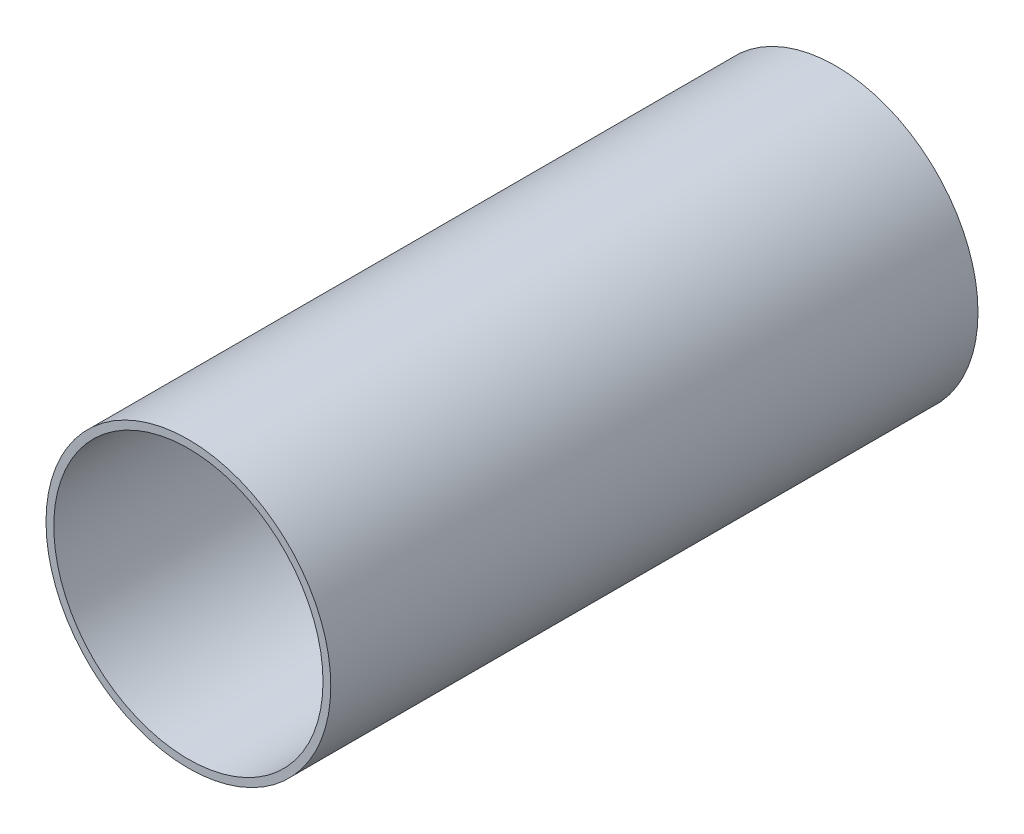
ISO-10303-21;
HEADER;
FILE_DESCRIPTION(('STEP AP214'),'2;1');
FILE_NAME('part.step','',(''),(''),'','','');
FILE_SCHEMA(('AUTOMOTIVE_DESIGN { 1 0 10303 214 1 1 1 1 }'));
ENDSEC;
DATA;
#1=APPLICATION_CONTEXT('core data for automotive mechanical design processes');
#2=APPLICATION_PROTOCOL_DEFINITION('international standard','automotive_design',2000,#1);
#3=PRODUCT_CONTEXT('',#1,'mechanical');
#4=PRODUCT('Part','Part','',(#3));
#5=PRODUCT_RELATED_PRODUCT_CATEGORY('part','',(#4));
#6=PRODUCT_DEFINITION_FORMATION('','',#4);
#7=PRODUCT_DEFINITION_CONTEXT('part definition',#1,'design');
#8=PRODUCT_DEFINITION('design','',#6,#7);
#9=PRODUCT_DEFINITION_SHAPE('','',#8);
#10=(LENGTH_UNIT() NAMED_UNIT(*) SI_UNIT(.MILLI.,.METRE.));
#11=(NAMED_UNIT(*) PLANE_ANGLE_UNIT() SI_UNIT($,.RADIAN.));
#12=(NAMED_UNIT(*) SI_UNIT($,.STERADIAN.) SOLID_ANGLE_UNIT());
#13=UNCERTAINTY_MEASURE_WITH_UNIT(LENGTH_MEASURE(1.E-05),#10,'distance_accuracy_value','');
#14=(GEOMETRIC_REPRESENTATION_CONTEXT(3) GLOBAL_UNCERTAINTY_ASSIGNED_CONTEXT((#13)) GLOBAL_UNIT_ASSIGNED_CONTEXT((#10,
#11,#12)) REPRESENTATION_CONTEXT('',''));
#15=CARTESIAN_POINT('',(0.,0.,0.));
#16=DIRECTION('',(0.,0.,1.));
#17=DIRECTION('',(1.,0.,0.));
#18=AXIS2_PLACEMENT_3D('',#15,#16,#17);
#19=CARTESIAN_POINT('',(0.,0.,250.));
#20=DIRECTION('',(0.,0.,1.));
#21=DIRECTION('',(1.,0.,0.));
#22=AXIS2_PLACEMENT_3D('',#19,#20,#21);
#23=PLANE('',#22);
#24=CARTESIAN_POINT('',(0.,0.,250.));
#25=DIRECTION('',(0.,0.,1.));
#26=DIRECTION('',(1.,0.,0.));
#27=AXIS2_PLACEMENT_3D('',#24,#25,#26);
#28=CIRCLE('',#27,55.);
#29=CARTESIAN_POINT('',(55.,0.,250.));
#30=VERTEX_POINT('',#29);
#31=EDGE_CURVE('E10',#30,#30,#28,.T.);
#32=ORIENTED_EDGE('',*,*,#31,.T.);
#33=EDGE_LOOP('',(#32));
#34=FACE_BOUND('',#33,.T.);
#35=CARTESIAN_POINT('',(0.,0.,250.));
#36=DIRECTION('',(0.,0.,1.));
#37=DIRECTION('',(1.,0.,0.));
#38=AXIS2_PLACEMENT_3D('',#35,#36,#37);
#39=CIRCLE('',#38,52.);
#40=CARTESIAN_POINT('',(52.,0.,250.));
#41=VERTEX_POINT('',#40);
#42=EDGE_CURVE('E50',#41,#41,#39,.T.);
#43=ORIENTED_EDGE('',*,*,#42,.F.);
#44=EDGE_LOOP('',(#43));
#45=FACE_BOUND('',#44,.T.);
#46=ADVANCED_FACE('F39',(#34,#45),#23,.T.);
#47=CARTESIAN_POINT('',(0.,0.,0.));
#48=DIRECTION('',(0.,0.,1.));
#49=DIRECTION('',(1.,0.,0.));
#50=AXIS2_PLACEMENT_3D('',#47,#48,#49);
#51=PLANE('',#50);
#52=CARTESIAN_POINT('',(0.,0.,0.));
#53=DIRECTION('',(0.,0.,1.));
#54=DIRECTION('',(1.,0.,0.));
#55=AXIS2_PLACEMENT_3D('',#52,#53,#54);
#56=CIRCLE('',#55,55.);
#57=CARTESIAN_POINT('',(55.,0.,0.));
#58=VERTEX_POINT('',#57);
#59=EDGE_CURVE('E43',#58,#58,#56,.T.);
#60=ORIENTED_EDGE('',*,*,#59,.F.);
#61=EDGE_LOOP('',(#60));
#62=FACE_BOUND('',#61,.T.);
#63=CARTESIAN_POINT('',(0.,0.,0.));
#64=DIRECTION('',(0.,0.,1.));
#65=DIRECTION('',(1.,0.,0.));
#66=AXIS2_PLACEMENT_3D('',#63,#64,#65);
#67=CIRCLE('',#66,52.);
#68=CARTESIAN_POINT('',(52.,0.,0.));
#69=VERTEX_POINT('',#68);
#70=EDGE_CURVE('E52',#69,#69,#67,.T.);
#71=ORIENTED_EDGE('',*,*,#70,.T.);
#72=EDGE_LOOP('',(#71));
#73=FACE_BOUND('',#72,.T.);
#74=ADVANCED_FACE('F62',(#62,#73),#51,.F.);
#75=CARTESIAN_POINT('',(0.,0.,250.));
#76=DIRECTION('',(0.,0.,-1.));
#77=DIRECTION('',(-1.,0.,0.));
#78=AXIS2_PLACEMENT_3D('',#75,#76,#77);
#79=CYLINDRICAL_SURFACE('',#78,55.);
#80=ORIENTED_EDGE('',*,*,#31,.F.);
#81=EDGE_LOOP('',(#80));
#82=FACE_BOUND('',#81,.T.);
#83=ORIENTED_EDGE('',*,*,#59,.T.);
#84=EDGE_LOOP('',(#83));
#85=FACE_BOUND('',#84,.T.);
#86=ADVANCED_FACE('F41',(#82,#85),#79,.T.);
#87=CARTESIAN_POINT('',(0.,0.,250.));
#88=DIRECTION('',(0.,0.,-1.));
#89=DIRECTION('',(-1.,0.,0.));
#90=AXIS2_PLACEMENT_3D('',#87,#88,#89);
#91=CYLINDRICAL_SURFACE('',#90,52.);
#92=ORIENTED_EDGE('',*,*,#42,.T.);
#93=EDGE_LOOP('',(#92));
#94=FACE_BOUND('',#93,.T.);
#95=ORIENTED_EDGE('',*,*,#70,.F.);
#96=EDGE_LOOP('',(#95));
#97=FACE_BOUND('',#96,.T.);
#98=ADVANCED_FACE('F58',(#94,#97),#91,.F.);
#99=CLOSED_SHELL('',(#46,#74,#86,#98));
#100=MANIFOLD_SOLID_BREP('B2',#99);
#101=ADVANCED_BREP_SHAPE_REPRESENTATION('',(#18,#100),#14);
#102=SHAPE_DEFINITION_REPRESENTATION(#9,#101);
ENDSEC;
END-ISO-10303-21;
